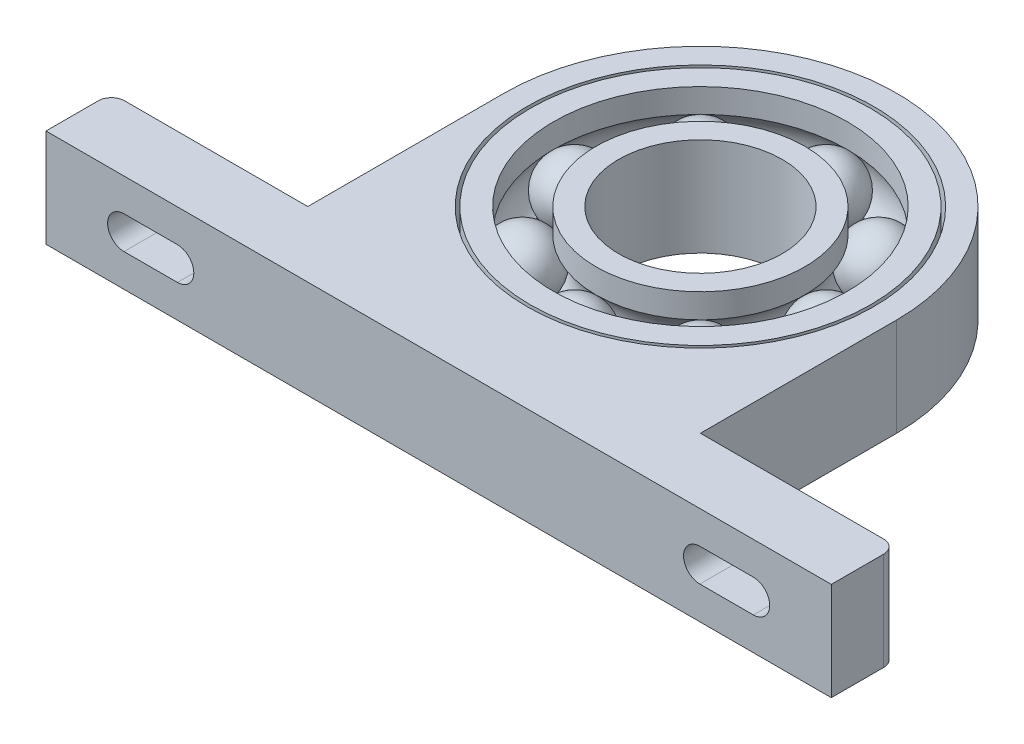
ISO-10303-21;
HEADER;
FILE_DESCRIPTION(('STEP AP214'),'2;1');
FILE_NAME('part.step','',(''),(''),'','','');
FILE_SCHEMA(('AUTOMOTIVE_DESIGN { 1 0 10303 214 1 1 1 1 }'));
ENDSEC;
DATA;
#1=APPLICATION_CONTEXT('core data for automotive mechanical design processes');
#2=APPLICATION_PROTOCOL_DEFINITION('international standard','automotive_design',2000,#1);
#3=PRODUCT_CONTEXT('',#1,'mechanical');
#4=PRODUCT('Part','Part','',(#3));
#5=PRODUCT_RELATED_PRODUCT_CATEGORY('part','',(#4));
#6=PRODUCT_DEFINITION_FORMATION('','',#4);
#7=PRODUCT_DEFINITION_CONTEXT('part definition',#1,'design');
#8=PRODUCT_DEFINITION('design','',#6,#7);
#9=PRODUCT_DEFINITION_SHAPE('','',#8);
#10=(LENGTH_UNIT() NAMED_UNIT(*) SI_UNIT(.MILLI.,.METRE.));
#11=(NAMED_UNIT(*) PLANE_ANGLE_UNIT() SI_UNIT($,.RADIAN.));
#12=(NAMED_UNIT(*) SI_UNIT($,.STERADIAN.) SOLID_ANGLE_UNIT());
#13=UNCERTAINTY_MEASURE_WITH_UNIT(LENGTH_MEASURE(1.E-05),#10,'distance_accuracy_value','');
#14=(GEOMETRIC_REPRESENTATION_CONTEXT(3) GLOBAL_UNCERTAINTY_ASSIGNED_CONTEXT((#13)) GLOBAL_UNIT_ASSIGNED_CONTEXT((#10,
#11,#12)) REPRESENTATION_CONTEXT('',''));
#15=CARTESIAN_POINT('',(0.,0.,0.));
#16=DIRECTION('',(0.,0.,1.));
#17=DIRECTION('',(1.,0.,0.));
#18=AXIS2_PLACEMENT_3D('',#15,#16,#17);
#19=CARTESIAN_POINT('',(60.,7.5,40.));
#20=DIRECTION('',(0.,0.,-1.));
#21=DIRECTION('',(-1.,0.,0.));
#22=AXIS2_PLACEMENT_3D('',#19,#20,#21);
#23=PLANE('',#22);
#24=CARTESIAN_POINT('',(-39.9157719621745,0.,40.));
#25=DIRECTION('',(0.,0.,-1.));
#26=DIRECTION('',(-1.,0.,0.));
#27=AXIS2_PLACEMENT_3D('',#24,#25,#26);
#28=CIRCLE('',#27,2.5);
#29=CARTESIAN_POINT('',(-39.9157719621745,2.5,40.));
#30=VERTEX_POINT('',#29);
#31=CARTESIAN_POINT('',(-39.9157719621745,-2.5,40.));
#32=VERTEX_POINT('',#31);
#33=EDGE_CURVE('E60',#30,#32,#28,.T.);
#34=ORIENTED_EDGE('',*,*,#33,.T.);
#35=DIRECTION('',(-1.,0.,0.));
#36=VECTOR('',#35,1.);
#37=CARTESIAN_POINT('',(60.,-2.50000000000001,40.));
#38=LINE('',#37,#36);
#39=CARTESIAN_POINT('',(-48.0842280378255,-2.5,40.));
#40=VERTEX_POINT('',#39);
#41=EDGE_CURVE('E12',#32,#40,#38,.T.);
#42=ORIENTED_EDGE('',*,*,#41,.T.);
#43=CARTESIAN_POINT('',(-48.0842280378255,0.,40.));
#44=DIRECTION('',(0.,0.,-1.));
#45=DIRECTION('',(-1.,0.,0.));
#46=AXIS2_PLACEMENT_3D('',#43,#44,#45);
#47=CIRCLE('',#46,2.5);
#48=CARTESIAN_POINT('',(-48.0842280378255,2.5,40.));
#49=VERTEX_POINT('',#48);
#50=EDGE_CURVE('E316',#40,#49,#47,.T.);
#51=ORIENTED_EDGE('',*,*,#50,.T.);
#52=DIRECTION('',(-1.,0.,0.));
#53=VECTOR('',#52,1.);
#54=CARTESIAN_POINT('',(60.,2.5,40.));
#55=LINE('',#54,#53);
#56=EDGE_CURVE('E183',#30,#49,#55,.T.);
#57=ORIENTED_EDGE('',*,*,#56,.F.);
#58=EDGE_LOOP('',(#34,#42,#51,#57));
#59=FACE_BOUND('',#58,.T.);
#60=DIRECTION('',(1.,0.,0.));
#61=VECTOR('',#60,1.);
#62=CARTESIAN_POINT('',(60.,-7.5,40.));
#63=LINE('',#62,#61);
#64=CARTESIAN_POINT('',(-60.,-7.5,40.));
#65=VERTEX_POINT('',#64);
#66=CARTESIAN_POINT('',(60.,-7.5,40.));
#67=VERTEX_POINT('',#66);
#68=EDGE_CURVE('E273',#65,#67,#63,.T.);
#69=ORIENTED_EDGE('',*,*,#68,.T.);
#70=DIRECTION('',(0.,-1.,0.));
#71=VECTOR('',#70,1.);
#72=CARTESIAN_POINT('',(60.,7.5,40.));
#73=LINE('',#72,#71);
#74=CARTESIAN_POINT('',(60.,7.5,40.));
#75=VERTEX_POINT('',#74);
#76=EDGE_CURVE('E286',#75,#67,#73,.T.);
#77=ORIENTED_EDGE('',*,*,#76,.F.);
#78=DIRECTION('',(1.,0.,0.));
#79=VECTOR('',#78,1.);
#80=CARTESIAN_POINT('',(60.,7.5,40.));
#81=LINE('',#80,#79);
#82=CARTESIAN_POINT('',(-60.,7.5,40.));
#83=VERTEX_POINT('',#82);
#84=EDGE_CURVE('E254',#83,#75,#81,.T.);
#85=ORIENTED_EDGE('',*,*,#84,.F.);
#86=DIRECTION('',(0.,-1.,0.));
#87=VECTOR('',#86,1.);
#88=CARTESIAN_POINT('',(-60.,7.5,40.));
#89=LINE('',#88,#87);
#90=EDGE_CURVE('E289',#83,#65,#89,.T.);
#91=ORIENTED_EDGE('',*,*,#90,.T.);
#92=EDGE_LOOP('',(#69,#77,#85,#91));
#93=FACE_BOUND('',#92,.T.);
#94=CARTESIAN_POINT('',(48.0842280378255,0.,40.));
#95=DIRECTION('',(0.,0.,-1.));
#96=DIRECTION('',(-1.,0.,0.));
#97=AXIS2_PLACEMENT_3D('',#94,#95,#96);
#98=CIRCLE('',#97,2.5);
#99=CARTESIAN_POINT('',(48.0842280378255,-2.5,40.));
#100=VERTEX_POINT('',#99);
#101=CARTESIAN_POINT('',(48.0842280378255,2.5,40.));
#102=VERTEX_POINT('',#101);
#103=EDGE_CURVE('E234',#100,#102,#98,.F.);
#104=ORIENTED_EDGE('',*,*,#103,.F.);
#105=DIRECTION('',(1.,0.,0.));
#106=VECTOR('',#105,1.);
#107=CARTESIAN_POINT('',(60.,-2.5,40.));
#108=LINE('',#107,#106);
#109=CARTESIAN_POINT('',(39.9157719621745,-2.5,40.));
#110=VERTEX_POINT('',#109);
#111=EDGE_CURVE('E203',#110,#100,#108,.T.);
#112=ORIENTED_EDGE('',*,*,#111,.F.);
#113=CARTESIAN_POINT('',(39.9157719621745,0.,40.));
#114=DIRECTION('',(0.,0.,-1.));
#115=DIRECTION('',(-1.,0.,0.));
#116=AXIS2_PLACEMENT_3D('',#113,#114,#115);
#117=CIRCLE('',#116,2.5);
#118=CARTESIAN_POINT('',(39.9157719621745,2.5,40.));
#119=VERTEX_POINT('',#118);
#120=EDGE_CURVE('E228',#119,#110,#117,.F.);
#121=ORIENTED_EDGE('',*,*,#120,.F.);
#122=DIRECTION('',(1.,0.,0.));
#123=VECTOR('',#122,1.);
#124=CARTESIAN_POINT('',(60.,2.5,40.));
#125=LINE('',#124,#123);
#126=EDGE_CURVE('E231',#119,#102,#125,.T.);
#127=ORIENTED_EDGE('',*,*,#126,.T.);
#128=EDGE_LOOP('',(#104,#112,#121,#127));
#129=FACE_BOUND('',#128,.T.);
#130=ADVANCED_FACE('F52',(#59,#93,#129),#23,.F.);
#131=CARTESIAN_POINT('',(30.,7.5,30.));
#132=DIRECTION('',(0.,0.,1.));
#133=DIRECTION('',(1.,0.,0.));
#134=AXIS2_PLACEMENT_3D('',#131,#132,#133);
#135=PLANE('',#134);
#136=DIRECTION('',(-1.,0.,0.));
#137=VECTOR('',#136,1.);
#138=CARTESIAN_POINT('',(30.,7.5,30.));
#139=LINE('',#138,#137);
#140=CARTESIAN_POINT('',(58.,7.5,30.));
#141=VERTEX_POINT('',#140);
#142=CARTESIAN_POINT('',(30.,7.5,30.));
#143=VERTEX_POINT('',#142);
#144=EDGE_CURVE('E259',#141,#143,#139,.T.);
#145=ORIENTED_EDGE('',*,*,#144,.F.);
#146=DIRECTION('',(0.,-1.,0.));
#147=VECTOR('',#146,1.);
#148=CARTESIAN_POINT('',(58.,7.5,30.));
#149=LINE('',#148,#147);
#150=CARTESIAN_POINT('',(58.,-7.5,30.));
#151=VERTEX_POINT('',#150);
#152=EDGE_CURVE('E298',#141,#151,#149,.T.);
#153=ORIENTED_EDGE('',*,*,#152,.T.);
#154=DIRECTION('',(-1.,0.,0.));
#155=VECTOR('',#154,1.);
#156=CARTESIAN_POINT('',(30.,-7.5,30.));
#157=LINE('',#156,#155);
#158=CARTESIAN_POINT('',(30.,-7.5,30.));
#159=VERTEX_POINT('',#158);
#160=EDGE_CURVE('E278',#151,#159,#157,.T.);
#161=ORIENTED_EDGE('',*,*,#160,.T.);
#162=DIRECTION('',(0.,-1.,0.));
#163=VECTOR('',#162,1.);
#164=CARTESIAN_POINT('',(30.,7.5,30.));
#165=LINE('',#164,#163);
#166=EDGE_CURVE('E283',#143,#159,#165,.T.);
#167=ORIENTED_EDGE('',*,*,#166,.F.);
#168=EDGE_LOOP('',(#145,#153,#161,#167));
#169=FACE_BOUND('',#168,.T.);
#170=CARTESIAN_POINT('',(48.0842280378255,0.,30.));
#171=DIRECTION('',(0.,0.,-1.));
#172=DIRECTION('',(-1.,0.,0.));
#173=AXIS2_PLACEMENT_3D('',#170,#171,#172);
#174=CIRCLE('',#173,2.5);
#175=CARTESIAN_POINT('',(48.0842280378255,-2.5,30.));
#176=VERTEX_POINT('',#175);
#177=CARTESIAN_POINT('',(48.0842280378255,2.5,30.));
#178=VERTEX_POINT('',#177);
#179=EDGE_CURVE('E206',#176,#178,#174,.F.);
#180=ORIENTED_EDGE('',*,*,#179,.T.);
#181=DIRECTION('',(1.,0.,0.));
#182=VECTOR('',#181,1.);
#183=CARTESIAN_POINT('',(0.,2.5,30.));
#184=LINE('',#183,#182);
#185=CARTESIAN_POINT('',(39.9157719621745,2.5,30.));
#186=VERTEX_POINT('',#185);
#187=EDGE_CURVE('E215',#186,#178,#184,.T.);
#188=ORIENTED_EDGE('',*,*,#187,.F.);
#189=CARTESIAN_POINT('',(39.9157719621745,0.,30.));
#190=DIRECTION('',(0.,0.,-1.));
#191=DIRECTION('',(-1.,0.,0.));
#192=AXIS2_PLACEMENT_3D('',#189,#190,#191);
#193=CIRCLE('',#192,2.5);
#194=CARTESIAN_POINT('',(39.9157719621745,-2.5,30.));
#195=VERTEX_POINT('',#194);
#196=EDGE_CURVE('E212',#186,#195,#193,.F.);
#197=ORIENTED_EDGE('',*,*,#196,.T.);
#198=DIRECTION('',(1.,0.,0.));
#199=VECTOR('',#198,1.);
#200=CARTESIAN_POINT('',(0.,-2.5,30.));
#201=LINE('',#200,#199);
#202=EDGE_CURVE('E209',#195,#176,#201,.T.);
#203=ORIENTED_EDGE('',*,*,#202,.T.);
#204=EDGE_LOOP('',(#180,#188,#197,#203));
#205=FACE_BOUND('',#204,.T.);
#206=ADVANCED_FACE('F339',(#169,#205),#135,.F.);
#207=CARTESIAN_POINT('',(0.,7.5,0.));
#208=DIRECTION('',(0.,1.,0.));
#209=DIRECTION('',(0.,0.,1.));
#210=AXIS2_PLACEMENT_3D('',#207,#208,#209);
#211=PLANE('',#210);
#212=DIRECTION('',(0.,0.,-1.));
#213=VECTOR('',#212,1.);
#214=CARTESIAN_POINT('',(60.,7.5,30.));
#215=LINE('',#214,#213);
#216=CARTESIAN_POINT('',(60.,7.5,32.));
#217=VERTEX_POINT('',#216);
#218=EDGE_CURVE('E256',#75,#217,#215,.T.);
#219=ORIENTED_EDGE('',*,*,#218,.T.);
#220=CARTESIAN_POINT('',(58.,7.5,32.));
#221=DIRECTION('',(0.,1.,0.));
#222=DIRECTION('',(0.,0.,1.));
#223=AXIS2_PLACEMENT_3D('',#220,#221,#222);
#224=CIRCLE('',#223,2.);
#225=EDGE_CURVE('E309',#217,#141,#224,.T.);
#226=ORIENTED_EDGE('',*,*,#225,.T.);
#227=ORIENTED_EDGE('',*,*,#144,.T.);
#228=DIRECTION('',(0.,0.,-1.));
#229=VECTOR('',#228,1.);
#230=CARTESIAN_POINT('',(30.,7.5,0.));
#231=LINE('',#230,#229);
#232=CARTESIAN_POINT('',(30.,7.5,0.));
#233=VERTEX_POINT('',#232);
#234=EDGE_CURVE('E261',#143,#233,#231,.T.);
#235=ORIENTED_EDGE('',*,*,#234,.T.);
#236=CARTESIAN_POINT('',(0.,7.5,0.));
#237=DIRECTION('',(0.,1.,0.));
#238=DIRECTION('',(0.,0.,1.));
#239=AXIS2_PLACEMENT_3D('',#236,#237,#238);
#240=CIRCLE('',#239,30.);
#241=CARTESIAN_POINT('',(-30.,7.5,0.));
#242=VERTEX_POINT('',#241);
#243=EDGE_CURVE('E243',#233,#242,#240,.T.);
#244=ORIENTED_EDGE('',*,*,#243,.T.);
#245=DIRECTION('',(0.,0.,1.));
#246=VECTOR('',#245,1.);
#247=CARTESIAN_POINT('',(-30.,7.5,30.));
#248=LINE('',#247,#246);
#249=CARTESIAN_POINT('',(-30.,7.5,30.));
#250=VERTEX_POINT('',#249);
#251=EDGE_CURVE('E246',#242,#250,#248,.T.);
#252=ORIENTED_EDGE('',*,*,#251,.T.);
#253=DIRECTION('',(-1.,0.,0.));
#254=VECTOR('',#253,1.);
#255=CARTESIAN_POINT('',(-60.,7.5,30.));
#256=LINE('',#255,#254);
#257=CARTESIAN_POINT('',(-58.,7.5,30.));
#258=VERTEX_POINT('',#257);
#259=EDGE_CURVE('E249',#250,#258,#256,.T.);
#260=ORIENTED_EDGE('',*,*,#259,.T.);
#261=CARTESIAN_POINT('',(-58.,7.5,32.));
#262=DIRECTION('',(0.,1.,0.));
#263=DIRECTION('',(0.,0.,1.));
#264=AXIS2_PLACEMENT_3D('',#261,#262,#263);
#265=CIRCLE('',#264,2.);
#266=CARTESIAN_POINT('',(-60.,7.5,32.));
#267=VERTEX_POINT('',#266);
#268=EDGE_CURVE('E307',#258,#267,#265,.T.);
#269=ORIENTED_EDGE('',*,*,#268,.T.);
#270=DIRECTION('',(0.,0.,1.));
#271=VECTOR('',#270,1.);
#272=CARTESIAN_POINT('',(-60.,7.5,40.));
#273=LINE('',#272,#271);
#274=EDGE_CURVE('E252',#267,#83,#273,.T.);
#275=ORIENTED_EDGE('',*,*,#274,.T.);
#276=ORIENTED_EDGE('',*,*,#84,.T.);
#277=EDGE_LOOP('',(#219,#226,#227,#235,#244,#252,#260,#269,#275,#276));
#278=FACE_BOUND('',#277,.T.);
#279=CARTESIAN_POINT('',(0.,7.5,0.));
#280=DIRECTION('',(0.,1.,0.));
#281=DIRECTION('',(0.,0.,1.));
#282=AXIS2_PLACEMENT_3D('',#279,#280,#281);
#283=CIRCLE('',#282,26.5);
#284=CARTESIAN_POINT('',(0.,7.5,26.5));
#285=VERTEX_POINT('',#284);
#286=EDGE_CURVE('E237',#285,#285,#283,.T.);
#287=ORIENTED_EDGE('',*,*,#286,.F.);
#288=EDGE_LOOP('',(#287));
#289=FACE_BOUND('',#288,.T.);
#290=ADVANCED_FACE('F344',(#278,#289),#211,.T.);
#291=CARTESIAN_POINT('',(0.,-7.5,0.));
#292=DIRECTION('',(0.,1.,0.));
#293=DIRECTION('',(0.,0.,1.));
#294=AXIS2_PLACEMENT_3D('',#291,#292,#293);
#295=PLANE('',#294);
#296=ORIENTED_EDGE('',*,*,#160,.F.);
#297=CARTESIAN_POINT('',(58.,-7.5,32.));
#298=DIRECTION('',(0.,1.,0.));
#299=DIRECTION('',(0.,0.,1.));
#300=AXIS2_PLACEMENT_3D('',#297,#298,#299);
#301=CIRCLE('',#300,2.);
#302=CARTESIAN_POINT('',(60.,-7.5,32.));
#303=VERTEX_POINT('',#302);
#304=EDGE_CURVE('E303',#151,#303,#301,.F.);
#305=ORIENTED_EDGE('',*,*,#304,.T.);
#306=DIRECTION('',(0.,0.,-1.));
#307=VECTOR('',#306,1.);
#308=CARTESIAN_POINT('',(60.,-7.5,30.));
#309=LINE('',#308,#307);
#310=EDGE_CURVE('E275',#67,#303,#309,.T.);
#311=ORIENTED_EDGE('',*,*,#310,.F.);
#312=ORIENTED_EDGE('',*,*,#68,.F.);
#313=DIRECTION('',(0.,0.,1.));
#314=VECTOR('',#313,1.);
#315=CARTESIAN_POINT('',(-60.,-7.5,40.));
#316=LINE('',#315,#314);
#317=CARTESIAN_POINT('',(-60.,-7.5,32.));
#318=VERTEX_POINT('',#317);
#319=EDGE_CURVE('E271',#318,#65,#316,.T.);
#320=ORIENTED_EDGE('',*,*,#319,.F.);
#321=CARTESIAN_POINT('',(-58.,-7.5,32.));
#322=DIRECTION('',(0.,1.,0.));
#323=DIRECTION('',(0.,0.,1.));
#324=AXIS2_PLACEMENT_3D('',#321,#322,#323);
#325=CIRCLE('',#324,2.);
#326=CARTESIAN_POINT('',(-58.,-7.5,30.));
#327=VERTEX_POINT('',#326);
#328=EDGE_CURVE('E301',#318,#327,#325,.F.);
#329=ORIENTED_EDGE('',*,*,#328,.T.);
#330=DIRECTION('',(-1.,0.,0.));
#331=VECTOR('',#330,1.);
#332=CARTESIAN_POINT('',(-60.,-7.5,30.));
#333=LINE('',#332,#331);
#334=CARTESIAN_POINT('',(-30.,-7.5,30.));
#335=VERTEX_POINT('',#334);
#336=EDGE_CURVE('E268',#335,#327,#333,.T.);
#337=ORIENTED_EDGE('',*,*,#336,.F.);
#338=DIRECTION('',(0.,0.,1.));
#339=VECTOR('',#338,1.);
#340=CARTESIAN_POINT('',(-30.,-7.5,30.));
#341=LINE('',#340,#339);
#342=CARTESIAN_POINT('',(-30.,-7.5,0.));
#343=VERTEX_POINT('',#342);
#344=EDGE_CURVE('E266',#343,#335,#341,.T.);
#345=ORIENTED_EDGE('',*,*,#344,.F.);
#346=CARTESIAN_POINT('',(0.,-7.5,0.));
#347=DIRECTION('',(0.,1.,0.));
#348=DIRECTION('',(0.,0.,1.));
#349=AXIS2_PLACEMENT_3D('',#346,#347,#348);
#350=CIRCLE('',#349,30.);
#351=CARTESIAN_POINT('',(30.,-7.5,0.));
#352=VERTEX_POINT('',#351);
#353=EDGE_CURVE('E240',#352,#343,#350,.T.);
#354=ORIENTED_EDGE('',*,*,#353,.F.);
#355=DIRECTION('',(0.,0.,-1.));
#356=VECTOR('',#355,1.);
#357=CARTESIAN_POINT('',(30.,-7.5,0.));
#358=LINE('',#357,#356);
#359=EDGE_CURVE('E247',#159,#352,#358,.T.);
#360=ORIENTED_EDGE('',*,*,#359,.F.);
#361=EDGE_LOOP('',(#296,#305,#311,#312,#320,#329,#337,#345,#354,#360));
#362=FACE_BOUND('',#361,.T.);
#363=CARTESIAN_POINT('',(0.,-7.5,0.));
#364=DIRECTION('',(0.,1.,0.));
#365=DIRECTION('',(0.,0.,1.));
#366=AXIS2_PLACEMENT_3D('',#363,#364,#365);
#367=CIRCLE('',#366,26.5);
#368=CARTESIAN_POINT('',(0.,-7.5,26.5));
#369=VERTEX_POINT('',#368);
#370=EDGE_CURVE('E236',#369,#369,#367,.T.);
#371=ORIENTED_EDGE('',*,*,#370,.T.);
#372=EDGE_LOOP('',(#371));
#373=FACE_BOUND('',#372,.T.);
#374=ADVANCED_FACE('F362',(#362,#373),#295,.F.);
#375=CARTESIAN_POINT('',(0.,7.5,0.));
#376=DIRECTION('',(0.,-1.,0.));
#377=DIRECTION('',(0.,0.,-1.));
#378=AXIS2_PLACEMENT_3D('',#375,#376,#377);
#379=CYLINDRICAL_SURFACE('',#378,30.);
#380=ORIENTED_EDGE('',*,*,#353,.T.);
#381=DIRECTION('',(0.,-1.,0.));
#382=VECTOR('',#381,1.);
#383=CARTESIAN_POINT('',(-30.,7.5,0.));
#384=LINE('',#383,#382);
#385=EDGE_CURVE('E295',#242,#343,#384,.T.);
#386=ORIENTED_EDGE('',*,*,#385,.F.);
#387=ORIENTED_EDGE('',*,*,#243,.F.);
#388=DIRECTION('',(0.,-1.,0.));
#389=VECTOR('',#388,1.);
#390=CARTESIAN_POINT('',(30.,7.5,0.));
#391=LINE('',#390,#389);
#392=EDGE_CURVE('E263',#233,#352,#391,.T.);
#393=ORIENTED_EDGE('',*,*,#392,.T.);
#394=EDGE_LOOP('',(#380,#386,#387,#393));
#395=FACE_BOUND('',#394,.T.);
#396=ADVANCED_FACE('F359',(#395),#379,.T.);
#397=CARTESIAN_POINT('',(-30.,7.5,30.));
#398=DIRECTION('',(1.,0.,0.));
#399=DIRECTION('',(0.,0.,-1.));
#400=AXIS2_PLACEMENT_3D('',#397,#398,#399);
#401=PLANE('',#400);
#402=ORIENTED_EDGE('',*,*,#344,.T.);
#403=DIRECTION('',(0.,-1.,0.));
#404=VECTOR('',#403,1.);
#405=CARTESIAN_POINT('',(-30.,7.5,30.));
#406=LINE('',#405,#404);
#407=EDGE_CURVE('E292',#250,#335,#406,.T.);
#408=ORIENTED_EDGE('',*,*,#407,.F.);
#409=ORIENTED_EDGE('',*,*,#251,.F.);
#410=ORIENTED_EDGE('',*,*,#385,.T.);
#411=EDGE_LOOP('',(#402,#408,#409,#410));
#412=FACE_BOUND('',#411,.T.);
#413=ADVANCED_FACE('F356',(#412),#401,.F.);
#414=CARTESIAN_POINT('',(-60.,7.5,30.));
#415=DIRECTION('',(0.,0.,1.));
#416=DIRECTION('',(1.,0.,0.));
#417=AXIS2_PLACEMENT_3D('',#414,#415,#416);
#418=PLANE('',#417);
#419=CARTESIAN_POINT('',(-48.0842280378255,0.,30.));
#420=DIRECTION('',(0.,0.,-1.));
#421=DIRECTION('',(-1.,0.,0.));
#422=AXIS2_PLACEMENT_3D('',#419,#420,#421);
#423=CIRCLE('',#422,2.5);
#424=CARTESIAN_POINT('',(-48.0842280378255,-2.5,30.));
#425=VERTEX_POINT('',#424);
#426=CARTESIAN_POINT('',(-48.0842280378255,2.5,30.));
#427=VERTEX_POINT('',#426);
#428=EDGE_CURVE('E189',#425,#427,#423,.T.);
#429=ORIENTED_EDGE('',*,*,#428,.F.);
#430=DIRECTION('',(-1.,0.,0.));
#431=VECTOR('',#430,1.);
#432=CARTESIAN_POINT('',(0.,-2.5,30.));
#433=LINE('',#432,#431);
#434=CARTESIAN_POINT('',(-39.9157719621745,-2.5,30.));
#435=VERTEX_POINT('',#434);
#436=EDGE_CURVE('E67',#435,#425,#433,.T.);
#437=ORIENTED_EDGE('',*,*,#436,.F.);
#438=CARTESIAN_POINT('',(-39.9157719621745,0.,30.));
#439=DIRECTION('',(0.,0.,-1.));
#440=DIRECTION('',(-1.,0.,0.));
#441=AXIS2_PLACEMENT_3D('',#438,#439,#440);
#442=CIRCLE('',#441,2.5);
#443=CARTESIAN_POINT('',(-39.9157719621745,2.5,30.));
#444=VERTEX_POINT('',#443);
#445=EDGE_CURVE('E196',#444,#435,#442,.T.);
#446=ORIENTED_EDGE('',*,*,#445,.F.);
#447=DIRECTION('',(-1.,0.,0.));
#448=VECTOR('',#447,1.);
#449=CARTESIAN_POINT('',(0.,2.5,30.));
#450=LINE('',#449,#448);
#451=EDGE_CURVE('E180',#444,#427,#450,.T.);
#452=ORIENTED_EDGE('',*,*,#451,.T.);
#453=EDGE_LOOP('',(#429,#437,#446,#452));
#454=FACE_BOUND('',#453,.T.);
#455=ORIENTED_EDGE('',*,*,#336,.T.);
#456=DIRECTION('',(0.,-1.,0.));
#457=VECTOR('',#456,1.);
#458=CARTESIAN_POINT('',(-58.,7.5,30.));
#459=LINE('',#458,#457);
#460=EDGE_CURVE('E314',#327,#258,#459,.F.);
#461=ORIENTED_EDGE('',*,*,#460,.T.);
#462=ORIENTED_EDGE('',*,*,#259,.F.);
#463=ORIENTED_EDGE('',*,*,#407,.T.);
#464=EDGE_LOOP('',(#455,#461,#462,#463));
#465=FACE_BOUND('',#464,.T.);
#466=ADVANCED_FACE('F193',(#454,#465),#418,.F.);
#467=CARTESIAN_POINT('',(-60.,7.5,40.));
#468=DIRECTION('',(1.,0.,0.));
#469=DIRECTION('',(0.,0.,-1.));
#470=AXIS2_PLACEMENT_3D('',#467,#468,#469);
#471=PLANE('',#470);
#472=ORIENTED_EDGE('',*,*,#274,.F.);
#473=DIRECTION('',(0.,-1.,0.));
#474=VECTOR('',#473,1.);
#475=CARTESIAN_POINT('',(-60.,7.5,32.));
#476=LINE('',#475,#474);
#477=EDGE_CURVE('E311',#267,#318,#476,.T.);
#478=ORIENTED_EDGE('',*,*,#477,.T.);
#479=ORIENTED_EDGE('',*,*,#319,.T.);
#480=ORIENTED_EDGE('',*,*,#90,.F.);
#481=EDGE_LOOP('',(#472,#478,#479,#480));
#482=FACE_BOUND('',#481,.T.);
#483=ADVANCED_FACE('F350',(#482),#471,.F.);
#484=CARTESIAN_POINT('',(60.,7.5,30.));
#485=DIRECTION('',(-1.,0.,0.));
#486=DIRECTION('',(0.,0.,1.));
#487=AXIS2_PLACEMENT_3D('',#484,#485,#486);
#488=PLANE('',#487);
#489=ORIENTED_EDGE('',*,*,#310,.T.);
#490=DIRECTION('',(0.,-1.,0.));
#491=VECTOR('',#490,1.);
#492=CARTESIAN_POINT('',(60.,7.5,32.));
#493=LINE('',#492,#491);
#494=EDGE_CURVE('E305',#303,#217,#493,.F.);
#495=ORIENTED_EDGE('',*,*,#494,.T.);
#496=ORIENTED_EDGE('',*,*,#218,.F.);
#497=ORIENTED_EDGE('',*,*,#76,.T.);
#498=EDGE_LOOP('',(#489,#495,#496,#497));
#499=FACE_BOUND('',#498,.T.);
#500=ADVANCED_FACE('F349',(#499),#488,.F.);
#501=CARTESIAN_POINT('',(30.,7.5,0.));
#502=DIRECTION('',(-1.,0.,0.));
#503=DIRECTION('',(0.,0.,1.));
#504=AXIS2_PLACEMENT_3D('',#501,#502,#503);
#505=PLANE('',#504);
#506=ORIENTED_EDGE('',*,*,#359,.T.);
#507=ORIENTED_EDGE('',*,*,#392,.F.);
#508=ORIENTED_EDGE('',*,*,#234,.F.);
#509=ORIENTED_EDGE('',*,*,#166,.T.);
#510=EDGE_LOOP('',(#506,#507,#508,#509));
#511=FACE_BOUND('',#510,.T.);
#512=ADVANCED_FACE('F374',(#511),#505,.F.);
#513=CARTESIAN_POINT('',(0.,7.5,0.));
#514=DIRECTION('',(0.,-1.,0.));
#515=DIRECTION('',(0.,0.,-1.));
#516=AXIS2_PLACEMENT_3D('',#513,#514,#515);
#517=CYLINDRICAL_SURFACE('',#516,26.5);
#518=ORIENTED_EDGE('',*,*,#286,.T.);
#519=EDGE_LOOP('',(#518));
#520=FACE_BOUND('',#519,.T.);
#521=ORIENTED_EDGE('',*,*,#370,.F.);
#522=EDGE_LOOP('',(#521));
#523=FACE_BOUND('',#522,.T.);
#524=ADVANCED_FACE('F366',(#520,#523),#517,.F.);
#525=CARTESIAN_POINT('',(58.,7.5,32.));
#526=DIRECTION('',(0.,-1.,0.));
#527=DIRECTION('',(0.,0.,-1.));
#528=AXIS2_PLACEMENT_3D('',#525,#526,#527);
#529=CYLINDRICAL_SURFACE('',#528,2.);
#530=ORIENTED_EDGE('',*,*,#225,.F.);
#531=ORIENTED_EDGE('',*,*,#494,.F.);
#532=ORIENTED_EDGE('',*,*,#304,.F.);
#533=ORIENTED_EDGE('',*,*,#152,.F.);
#534=EDGE_LOOP('',(#530,#531,#532,#533));
#535=FACE_BOUND('',#534,.T.);
#536=ADVANCED_FACE('F364',(#535),#529,.T.);
#537=CARTESIAN_POINT('',(-58.,7.5,32.));
#538=DIRECTION('',(0.,-1.,0.));
#539=DIRECTION('',(0.,0.,-1.));
#540=AXIS2_PLACEMENT_3D('',#537,#538,#539);
#541=CYLINDRICAL_SURFACE('',#540,2.);
#542=ORIENTED_EDGE('',*,*,#268,.F.);
#543=ORIENTED_EDGE('',*,*,#460,.F.);
#544=ORIENTED_EDGE('',*,*,#328,.F.);
#545=ORIENTED_EDGE('',*,*,#477,.F.);
#546=EDGE_LOOP('',(#542,#543,#544,#545));
#547=FACE_BOUND('',#546,.T.);
#548=ADVANCED_FACE('F54',(#547),#541,.T.);
#549=CARTESIAN_POINT('',(48.0842280378255,0.,45.));
#550=DIRECTION('',(0.,0.,-1.));
#551=DIRECTION('',(-1.,0.,0.));
#552=AXIS2_PLACEMENT_3D('',#549,#550,#551);
#553=CYLINDRICAL_SURFACE('',#552,2.5);
#554=ORIENTED_EDGE('',*,*,#103,.T.);
#555=DIRECTION('',(0.,0.,-1.));
#556=VECTOR('',#555,1.);
#557=CARTESIAN_POINT('',(48.0842280378255,2.5,45.));
#558=LINE('',#557,#556);
#559=EDGE_CURVE('E219',#102,#178,#558,.T.);
#560=ORIENTED_EDGE('',*,*,#559,.T.);
#561=ORIENTED_EDGE('',*,*,#179,.F.);
#562=DIRECTION('',(0.,0.,-1.));
#563=VECTOR('',#562,1.);
#564=CARTESIAN_POINT('',(48.0842280378255,-2.5,45.));
#565=LINE('',#564,#563);
#566=EDGE_CURVE('E218',#100,#176,#565,.T.);
#567=ORIENTED_EDGE('',*,*,#566,.F.);
#568=EDGE_LOOP('',(#554,#560,#561,#567));
#569=FACE_BOUND('',#568,.T.);
#570=ADVANCED_FACE('F372',(#569),#553,.F.);
#571=CARTESIAN_POINT('',(0.,2.5,45.));
#572=DIRECTION('',(0.,1.,0.));
#573=DIRECTION('',(0.,0.,1.));
#574=AXIS2_PLACEMENT_3D('',#571,#572,#573);
#575=PLANE('',#574);
#576=DIRECTION('',(0.,0.,-1.));
#577=VECTOR('',#576,1.);
#578=CARTESIAN_POINT('',(39.9157719621745,2.5,45.));
#579=LINE('',#578,#577);
#580=EDGE_CURVE('E221',#119,#186,#579,.T.);
#581=ORIENTED_EDGE('',*,*,#580,.T.);
#582=ORIENTED_EDGE('',*,*,#187,.T.);
#583=ORIENTED_EDGE('',*,*,#559,.F.);
#584=ORIENTED_EDGE('',*,*,#126,.F.);
#585=EDGE_LOOP('',(#581,#582,#583,#584));
#586=FACE_BOUND('',#585,.T.);
#587=ADVANCED_FACE('F424',(#586),#575,.F.);
#588=CARTESIAN_POINT('',(39.9157719621745,0.,45.));
#589=DIRECTION('',(0.,0.,-1.));
#590=DIRECTION('',(-1.,0.,0.));
#591=AXIS2_PLACEMENT_3D('',#588,#589,#590);
#592=CYLINDRICAL_SURFACE('',#591,2.5);
#593=ORIENTED_EDGE('',*,*,#120,.T.);
#594=DIRECTION('',(0.,0.,-1.));
#595=VECTOR('',#594,1.);
#596=CARTESIAN_POINT('',(39.9157719621745,-2.5,45.));
#597=LINE('',#596,#595);
#598=EDGE_CURVE('E223',#110,#195,#597,.T.);
#599=ORIENTED_EDGE('',*,*,#598,.T.);
#600=ORIENTED_EDGE('',*,*,#196,.F.);
#601=ORIENTED_EDGE('',*,*,#580,.F.);
#602=EDGE_LOOP('',(#593,#599,#600,#601));
#603=FACE_BOUND('',#602,.T.);
#604=ADVANCED_FACE('F333',(#603),#592,.F.);
#605=CARTESIAN_POINT('',(0.,-2.5,45.));
#606=DIRECTION('',(0.,1.,0.));
#607=DIRECTION('',(-1.,0.,0.));
#608=AXIS2_PLACEMENT_3D('',#605,#606,#607);
#609=PLANE('',#608);
#610=ORIENTED_EDGE('',*,*,#111,.T.);
#611=ORIENTED_EDGE('',*,*,#566,.T.);
#612=ORIENTED_EDGE('',*,*,#202,.F.);
#613=ORIENTED_EDGE('',*,*,#598,.F.);
#614=EDGE_LOOP('',(#610,#611,#612,#613));
#615=FACE_BOUND('',#614,.T.);
#616=ADVANCED_FACE('F326',(#615),#609,.T.);
#617=CARTESIAN_POINT('',(0.,-2.5,45.));
#618=DIRECTION('',(0.,-1.,0.));
#619=DIRECTION('',(1.,0.,0.));
#620=AXIS2_PLACEMENT_3D('',#617,#618,#619);
#621=PLANE('',#620);
#622=DIRECTION('',(0.,0.,-1.));
#623=VECTOR('',#622,1.);
#624=CARTESIAN_POINT('',(-39.9157719621745,-2.5,45.));
#625=LINE('',#624,#623);
#626=EDGE_CURVE('E201',#32,#435,#625,.T.);
#627=ORIENTED_EDGE('',*,*,#626,.T.);
#628=ORIENTED_EDGE('',*,*,#436,.T.);
#629=DIRECTION('',(0.,0.,-1.));
#630=VECTOR('',#629,1.);
#631=CARTESIAN_POINT('',(-48.0842280378255,-2.5,45.));
#632=LINE('',#631,#630);
#633=EDGE_CURVE('E186',#40,#425,#632,.T.);
#634=ORIENTED_EDGE('',*,*,#633,.F.);
#635=ORIENTED_EDGE('',*,*,#41,.F.);
#636=EDGE_LOOP('',(#627,#628,#634,#635));
#637=FACE_BOUND('',#636,.T.);
#638=ADVANCED_FACE('F324',(#637),#621,.F.);
#639=CARTESIAN_POINT('',(-39.9157719621745,0.,45.));
#640=DIRECTION('',(0.,0.,-1.));
#641=DIRECTION('',(-1.,0.,0.));
#642=AXIS2_PLACEMENT_3D('',#639,#640,#641);
#643=CYLINDRICAL_SURFACE('',#642,2.5);
#644=DIRECTION('',(0.,0.,-1.));
#645=VECTOR('',#644,1.);
#646=CARTESIAN_POINT('',(-39.9157719621745,2.5,45.));
#647=LINE('',#646,#645);
#648=EDGE_CURVE('E185',#30,#444,#647,.T.);
#649=ORIENTED_EDGE('',*,*,#648,.T.);
#650=ORIENTED_EDGE('',*,*,#445,.T.);
#651=ORIENTED_EDGE('',*,*,#626,.F.);
#652=ORIENTED_EDGE('',*,*,#33,.F.);
#653=EDGE_LOOP('',(#649,#650,#651,#652));
#654=FACE_BOUND('',#653,.T.);
#655=ADVANCED_FACE('F323',(#654),#643,.F.);
#656=CARTESIAN_POINT('',(0.,2.5,45.));
#657=DIRECTION('',(0.,-1.,0.));
#658=DIRECTION('',(0.,0.,-1.));
#659=AXIS2_PLACEMENT_3D('',#656,#657,#658);
#660=PLANE('',#659);
#661=ORIENTED_EDGE('',*,*,#56,.T.);
#662=DIRECTION('',(0.,0.,-1.));
#663=VECTOR('',#662,1.);
#664=CARTESIAN_POINT('',(-48.0842280378255,2.5,45.));
#665=LINE('',#664,#663);
#666=EDGE_CURVE('E75',#49,#427,#665,.T.);
#667=ORIENTED_EDGE('',*,*,#666,.T.);
#668=ORIENTED_EDGE('',*,*,#451,.F.);
#669=ORIENTED_EDGE('',*,*,#648,.F.);
#670=EDGE_LOOP('',(#661,#667,#668,#669));
#671=FACE_BOUND('',#670,.T.);
#672=ADVANCED_FACE('F177',(#671),#660,.T.);
#673=CARTESIAN_POINT('',(-48.0842280378255,0.,45.));
#674=DIRECTION('',(0.,0.,-1.));
#675=DIRECTION('',(-1.,0.,0.));
#676=AXIS2_PLACEMENT_3D('',#673,#674,#675);
#677=CYLINDRICAL_SURFACE('',#676,2.5);
#678=ORIENTED_EDGE('',*,*,#633,.T.);
#679=ORIENTED_EDGE('',*,*,#428,.T.);
#680=ORIENTED_EDGE('',*,*,#666,.F.);
#681=ORIENTED_EDGE('',*,*,#50,.F.);
#682=EDGE_LOOP('',(#678,#679,#680,#681));
#683=FACE_BOUND('',#682,.T.);
#684=ADVANCED_FACE('F190',(#683),#677,.F.);
#685=CLOSED_SHELL('',(#130,#206,#290,#374,#396,#413,#466,#483,#500,#512,#524,#536,#548,#570,
#587,#604,#616,#638,#655,#672,#684));
#686=MANIFOLD_SOLID_BREP('B2',#685);
#687=CARTESIAN_POINT('',(-13.5968790899985,0.,-13.5968790899982));
#688=DIRECTION('',(0.,-1.,0.));
#689=DIRECTION('',(-0.707106781186556,0.,-0.707106781186539));
#690=AXIS2_PLACEMENT_3D('',#687,#688,#689);
#691=SPHERICAL_SURFACE('',#690,5.);
#692=CARTESIAN_POINT('',(-13.5968790899985,-5.,-13.5968790899982));
#693=VERTEX_POINT('',#692);
#694=VERTEX_LOOP('',#693);
#695=FACE_BOUND('',#694,.T.);
#696=ADVANCED_FACE('F639',(#695),#691,.T.);
#697=CLOSED_SHELL('',(#696));
#698=MANIFOLD_SOLID_BREP('B6',#697);
#699=CARTESIAN_POINT('',(-2.01411940341913E-13,0.,-19.2288908150228));
#700=DIRECTION('',(0.,-1.,0.));
#701=DIRECTION('',(0.,0.,-1.));
#702=AXIS2_PLACEMENT_3D('',#699,#700,#701);
#703=SPHERICAL_SURFACE('',#702,5.);
#704=CARTESIAN_POINT('',(-2.01411940341913E-13,-5.,-19.2288908150228));
#705=VERTEX_POINT('',#704);
#706=VERTEX_LOOP('',#705);
#707=FACE_BOUND('',#706,.T.);
#708=ADVANCED_FACE('F663',(#707),#703,.T.);
#709=CLOSED_SHELL('',(#708));
#710=MANIFOLD_SOLID_BREP('B48',#709);
#711=CARTESIAN_POINT('',(13.5968790899982,0.,-13.5968790899985));
#712=DIRECTION('',(0.,-1.,0.));
#713=DIRECTION('',(0.707106781186541,0.,-0.707106781186554));
#714=AXIS2_PLACEMENT_3D('',#711,#712,#713);
#715=SPHERICAL_SURFACE('',#714,5.);
#716=CARTESIAN_POINT('',(13.5968790899982,-5.,-13.5968790899985));
#717=VERTEX_POINT('',#716);
#718=VERTEX_LOOP('',#717);
#719=FACE_BOUND('',#718,.T.);
#720=ADVANCED_FACE('F687',(#719),#715,.T.);
#721=CLOSED_SHELL('',(#720));
#722=MANIFOLD_SOLID_BREP('B635',#721);
#723=CARTESIAN_POINT('',(19.2288908150228,0.,0.));
#724=DIRECTION('',(0.,-1.,0.));
#725=DIRECTION('',(1.,0.,0.));
#726=AXIS2_PLACEMENT_3D('',#723,#724,#725);
#727=SPHERICAL_SURFACE('',#726,5.);
#728=CARTESIAN_POINT('',(19.2288908150228,-5.,0.));
#729=VERTEX_POINT('',#728);
#730=VERTEX_LOOP('',#729);
#731=FACE_BOUND('',#730,.T.);
#732=ADVANCED_FACE('F711',(#731),#727,.T.);
#733=CLOSED_SHELL('',(#732));
#734=MANIFOLD_SOLID_BREP('B659',#733);
#735=CARTESIAN_POINT('',(13.5968790899984,0.,13.5968790899983));
#736=DIRECTION('',(0.,-1.,0.));
#737=DIRECTION('',(0.707106781186551,0.,0.707106781186544));
#738=AXIS2_PLACEMENT_3D('',#735,#736,#737);
#739=SPHERICAL_SURFACE('',#738,5.);
#740=CARTESIAN_POINT('',(13.5968790899984,-5.,13.5968790899983));
#741=VERTEX_POINT('',#740);
#742=VERTEX_LOOP('',#741);
#743=FACE_BOUND('',#742,.T.);
#744=ADVANCED_FACE('F735',(#743),#739,.T.);
#745=CLOSED_SHELL('',(#744));
#746=MANIFOLD_SOLID_BREP('B683',#745);
#747=CARTESIAN_POINT('',(0.,0.,19.2288908150228));
#748=DIRECTION('',(0.,-1.,0.));
#749=DIRECTION('',(0.,0.,1.));
#750=AXIS2_PLACEMENT_3D('',#747,#748,#749);
#751=SPHERICAL_SURFACE('',#750,5.);
#752=CARTESIAN_POINT('',(0.,-5.,19.2288908150228));
#753=VERTEX_POINT('',#752);
#754=VERTEX_LOOP('',#753);
#755=FACE_BOUND('',#754,.T.);
#756=ADVANCED_FACE('F759',(#755),#751,.T.);
#757=CLOSED_SHELL('',(#756));
#758=MANIFOLD_SOLID_BREP('B707',#757);
#759=CARTESIAN_POINT('',(-13.5968790899983,0.,13.5968790899984));
#760=DIRECTION('',(0.,-1.,0.));
#761=DIRECTION('',(-0.707106781186546,0.,0.707106781186549));
#762=AXIS2_PLACEMENT_3D('',#759,#760,#761);
#763=SPHERICAL_SURFACE('',#762,5.);
#764=CARTESIAN_POINT('',(-13.5968790899983,-5.,13.5968790899984));
#765=VERTEX_POINT('',#764);
#766=VERTEX_LOOP('',#765);
#767=FACE_BOUND('',#766,.T.);
#768=ADVANCED_FACE('F785',(#767),#763,.T.);
#769=CLOSED_SHELL('',(#768));
#770=MANIFOLD_SOLID_BREP('B731',#769);
#771=CARTESIAN_POINT('',(0.,0.,0.));
#772=DIRECTION('',(0.,-1.,0.));
#773=DIRECTION('',(0.,0.,-1.));
#774=AXIS2_PLACEMENT_3D('',#771,#772,#773);
#775=TOROIDAL_SURFACE('',#774,19.2288908150228,5.);
#776=CARTESIAN_POINT('',(0.,-3.81762545368995,0.));
#777=DIRECTION('',(0.,-1.,0.));
#778=DIRECTION('',(0.,0.,-1.));
#779=AXIS2_PLACEMENT_3D('',#776,#777,#778);
#780=CIRCLE('',#779,22.4577816300456);
#781=CARTESIAN_POINT('',(0.,-3.81762545368995,-22.4577816300456));
#782=VERTEX_POINT('',#781);
#783=EDGE_CURVE('E833',#782,#782,#780,.T.);
#784=ORIENTED_EDGE('',*,*,#783,.T.);
#785=EDGE_LOOP('',(#784));
#786=FACE_BOUND('',#785,.T.);
#787=CARTESIAN_POINT('',(0.,3.81762545368996,0.));
#788=DIRECTION('',(0.,-1.,0.));
#789=DIRECTION('',(0.,0.,-1.));
#790=AXIS2_PLACEMENT_3D('',#787,#788,#789);
#791=CIRCLE('',#790,22.4577816300456);
#792=CARTESIAN_POINT('',(0.,3.81762545368996,-22.4577816300456));
#793=VERTEX_POINT('',#792);
#794=EDGE_CURVE('E784',#793,#793,#791,.T.);
#795=ORIENTED_EDGE('',*,*,#794,.F.);
#796=EDGE_LOOP('',(#795));
#797=FACE_BOUND('',#796,.T.);
#798=ADVANCED_FACE('F811',(#786,#797),#775,.F.);
#799=CARTESIAN_POINT('',(0.,-10.6091466339345,0.));
#800=DIRECTION('',(0.,-1.,0.));
#801=DIRECTION('',(0.,0.,-1.));
#802=AXIS2_PLACEMENT_3D('',#799,#800,#801);
#803=CYLINDRICAL_SURFACE('',#802,22.4577816300456);
#804=ORIENTED_EDGE('',*,*,#794,.T.);
#805=EDGE_LOOP('',(#804));
#806=FACE_BOUND('',#805,.T.);
#807=CARTESIAN_POINT('',(0.,7.5,0.));
#808=DIRECTION('',(0.,-1.,0.));
#809=DIRECTION('',(0.,0.,-1.));
#810=AXIS2_PLACEMENT_3D('',#807,#808,#809);
#811=CIRCLE('',#810,22.4577816300456);
#812=CARTESIAN_POINT('',(0.,7.5,-22.4577816300456));
#813=VERTEX_POINT('',#812);
#814=EDGE_CURVE('E817',#813,#813,#811,.T.);
#815=ORIENTED_EDGE('',*,*,#814,.F.);
#816=EDGE_LOOP('',(#815));
#817=FACE_BOUND('',#816,.T.);
#818=ADVANCED_FACE('F851',(#806,#817),#803,.F.);
#819=CARTESIAN_POINT('',(0.,7.5,0.));
#820=DIRECTION('',(0.,1.,0.));
#821=DIRECTION('',(0.,0.,1.));
#822=AXIS2_PLACEMENT_3D('',#819,#820,#821);
#823=PLANE('',#822);
#824=ORIENTED_EDGE('',*,*,#814,.T.);
#825=EDGE_LOOP('',(#824));
#826=FACE_BOUND('',#825,.T.);
#827=CARTESIAN_POINT('',(0.,7.5,0.));
#828=DIRECTION('',(0.,-1.,0.));
#829=DIRECTION('',(0.,0.,-1.));
#830=AXIS2_PLACEMENT_3D('',#827,#828,#829);
#831=CIRCLE('',#830,26.);
#832=CARTESIAN_POINT('',(0.,7.5,-26.));
#833=VERTEX_POINT('',#832);
#834=EDGE_CURVE('E821',#833,#833,#831,.T.);
#835=ORIENTED_EDGE('',*,*,#834,.F.);
#836=EDGE_LOOP('',(#835));
#837=FACE_BOUND('',#836,.T.);
#838=ADVANCED_FACE('F855',(#826,#837),#823,.T.);
#839=CARTESIAN_POINT('',(0.,-10.6091466339345,0.));
#840=DIRECTION('',(0.,-1.,0.));
#841=DIRECTION('',(0.,0.,-1.));
#842=AXIS2_PLACEMENT_3D('',#839,#840,#841);
#843=CYLINDRICAL_SURFACE('',#842,26.);
#844=CARTESIAN_POINT('',(0.,-7.5,0.));
#845=DIRECTION('',(0.,-1.,0.));
#846=DIRECTION('',(0.,0.,-1.));
#847=AXIS2_PLACEMENT_3D('',#844,#845,#846);
#848=CIRCLE('',#847,26.);
#849=CARTESIAN_POINT('',(0.,-7.5,-26.));
#850=VERTEX_POINT('',#849);
#851=EDGE_CURVE('E825',#850,#850,#848,.T.);
#852=ORIENTED_EDGE('',*,*,#851,.F.);
#853=EDGE_LOOP('',(#852));
#854=FACE_BOUND('',#853,.T.);
#855=ORIENTED_EDGE('',*,*,#834,.T.);
#856=EDGE_LOOP('',(#855));
#857=FACE_BOUND('',#856,.T.);
#858=ADVANCED_FACE('F847',(#854,#857),#843,.T.);
#859=CARTESIAN_POINT('',(0.,-7.5,0.));
#860=DIRECTION('',(0.,1.,0.));
#861=DIRECTION('',(0.,0.,1.));
#862=AXIS2_PLACEMENT_3D('',#859,#860,#861);
#863=PLANE('',#862);
#864=CARTESIAN_POINT('',(0.,-7.5,0.));
#865=DIRECTION('',(0.,-1.,0.));
#866=DIRECTION('',(0.,0.,-1.));
#867=AXIS2_PLACEMENT_3D('',#864,#865,#866);
#868=CIRCLE('',#867,22.4577816300456);
#869=CARTESIAN_POINT('',(0.,-7.5,-22.4577816300456));
#870=VERTEX_POINT('',#869);
#871=EDGE_CURVE('E830',#870,#870,#868,.T.);
#872=ORIENTED_EDGE('',*,*,#871,.F.);
#873=EDGE_LOOP('',(#872));
#874=FACE_BOUND('',#873,.T.);
#875=ORIENTED_EDGE('',*,*,#851,.T.);
#876=EDGE_LOOP('',(#875));
#877=FACE_BOUND('',#876,.T.);
#878=ADVANCED_FACE('F841',(#874,#877),#863,.F.);
#879=CARTESIAN_POINT('',(0.,-10.6091466339345,0.));
#880=DIRECTION('',(0.,-1.,0.));
#881=DIRECTION('',(0.,0.,-1.));
#882=AXIS2_PLACEMENT_3D('',#879,#880,#881);
#883=CYLINDRICAL_SURFACE('',#882,22.4577816300456);
#884=ORIENTED_EDGE('',*,*,#871,.T.);
#885=EDGE_LOOP('',(#884));
#886=FACE_BOUND('',#885,.T.);
#887=ORIENTED_EDGE('',*,*,#783,.F.);
#888=EDGE_LOOP('',(#887));
#889=FACE_BOUND('',#888,.T.);
#890=ADVANCED_FACE('F839',(#886,#889),#883,.F.);
#891=CLOSED_SHELL('',(#798,#818,#838,#858,#878,#890));
#892=MANIFOLD_SOLID_BREP('B755',#891);
#893=CARTESIAN_POINT('',(0.,0.,0.));
#894=DIRECTION('',(0.,-1.,0.));
#895=DIRECTION('',(0.,0.,-1.));
#896=AXIS2_PLACEMENT_3D('',#893,#894,#895);
#897=TOROIDAL_SURFACE('',#896,19.2288908150228,5.);
#898=CARTESIAN_POINT('',(0.,3.78151354618197,0.));
#899=DIRECTION('',(0.,-1.,0.));
#900=DIRECTION('',(0.,0.,-1.));
#901=AXIS2_PLACEMENT_3D('',#898,#899,#900);
#902=CIRCLE('',#901,15.9577816300456);
#903=CARTESIAN_POINT('',(0.,3.78151354618197,-15.9577816300456));
#904=VERTEX_POINT('',#903);
#905=EDGE_CURVE('E939',#904,#904,#902,.T.);
#906=ORIENTED_EDGE('',*,*,#905,.T.);
#907=EDGE_LOOP('',(#906));
#908=FACE_BOUND('',#907,.T.);
#909=CARTESIAN_POINT('',(0.,-3.78151354618197,0.));
#910=DIRECTION('',(0.,-1.,0.));
#911=DIRECTION('',(0.,0.,-1.));
#912=AXIS2_PLACEMENT_3D('',#909,#910,#911);
#913=CIRCLE('',#912,15.9577816300456);
#914=CARTESIAN_POINT('',(0.,-3.78151354618197,-15.9577816300456));
#915=VERTEX_POINT('',#914);
#916=EDGE_CURVE('E810',#915,#915,#913,.T.);
#917=ORIENTED_EDGE('',*,*,#916,.F.);
#918=EDGE_LOOP('',(#917));
#919=FACE_BOUND('',#918,.T.);
#920=ADVANCED_FACE('F917',(#908,#919),#897,.F.);
#921=CARTESIAN_POINT('',(0.,-10.6091466339345,0.));
#922=DIRECTION('',(0.,-1.,0.));
#923=DIRECTION('',(0.,0.,-1.));
#924=AXIS2_PLACEMENT_3D('',#921,#922,#923);
#925=CYLINDRICAL_SURFACE('',#924,15.9577816300456);
#926=CARTESIAN_POINT('',(0.,-7.5,0.));
#927=DIRECTION('',(0.,-1.,0.));
#928=DIRECTION('',(0.,0.,-1.));
#929=AXIS2_PLACEMENT_3D('',#926,#927,#928);
#930=CIRCLE('',#929,15.9577816300456);
#931=CARTESIAN_POINT('',(0.,-7.5,-15.9577816300456));
#932=VERTEX_POINT('',#931);
#933=EDGE_CURVE('E923',#932,#932,#930,.T.);
#934=ORIENTED_EDGE('',*,*,#933,.F.);
#935=EDGE_LOOP('',(#934));
#936=FACE_BOUND('',#935,.T.);
#937=ORIENTED_EDGE('',*,*,#916,.T.);
#938=EDGE_LOOP('',(#937));
#939=FACE_BOUND('',#938,.T.);
#940=ADVANCED_FACE('F963',(#936,#939),#925,.T.);
#941=CARTESIAN_POINT('',(0.,-7.49999999999999,0.));
#942=DIRECTION('',(0.,1.,0.));
#943=DIRECTION('',(0.,0.,1.));
#944=AXIS2_PLACEMENT_3D('',#941,#942,#943);
#945=PLANE('',#944);
#946=CARTESIAN_POINT('',(0.,-7.49999999999999,0.));
#947=DIRECTION('',(0.,-1.,0.));
#948=DIRECTION('',(0.,0.,-1.));
#949=AXIS2_PLACEMENT_3D('',#946,#947,#948);
#950=CIRCLE('',#949,12.5);
#951=CARTESIAN_POINT('',(0.,-7.49999999999999,-12.5));
#952=VERTEX_POINT('',#951);
#953=EDGE_CURVE('E927',#952,#952,#950,.T.);
#954=ORIENTED_EDGE('',*,*,#953,.F.);
#955=EDGE_LOOP('',(#954));
#956=FACE_BOUND('',#955,.T.);
#957=ORIENTED_EDGE('',*,*,#933,.T.);
#958=EDGE_LOOP('',(#957));
#959=FACE_BOUND('',#958,.T.);
#960=ADVANCED_FACE('F959',(#956,#959),#945,.F.);
#961=CARTESIAN_POINT('',(0.,-10.6091466339345,0.));
#962=DIRECTION('',(0.,-1.,0.));
#963=DIRECTION('',(0.,0.,-1.));
#964=AXIS2_PLACEMENT_3D('',#961,#962,#963);
#965=CYLINDRICAL_SURFACE('',#964,12.5);
#966=ORIENTED_EDGE('',*,*,#953,.T.);
#967=EDGE_LOOP('',(#966));
#968=FACE_BOUND('',#967,.T.);
#969=CARTESIAN_POINT('',(0.,7.50000000000001,0.));
#970=DIRECTION('',(0.,-1.,0.));
#971=DIRECTION('',(0.,0.,-1.));
#972=AXIS2_PLACEMENT_3D('',#969,#970,#971);
#973=CIRCLE('',#972,12.5);
#974=CARTESIAN_POINT('',(0.,7.50000000000001,-12.5));
#975=VERTEX_POINT('',#974);
#976=EDGE_CURVE('E931',#975,#975,#973,.T.);
#977=ORIENTED_EDGE('',*,*,#976,.F.);
#978=EDGE_LOOP('',(#977));
#979=FACE_BOUND('',#978,.T.);
#980=ADVANCED_FACE('F953',(#968,#979),#965,.F.);
#981=CARTESIAN_POINT('',(0.,7.5,0.));
#982=DIRECTION('',(0.,1.,0.));
#983=DIRECTION('',(0.,0.,1.));
#984=AXIS2_PLACEMENT_3D('',#981,#982,#983);
#985=PLANE('',#984);
#986=ORIENTED_EDGE('',*,*,#976,.T.);
#987=EDGE_LOOP('',(#986));
#988=FACE_BOUND('',#987,.T.);
#989=CARTESIAN_POINT('',(0.,7.5,0.));
#990=DIRECTION('',(0.,-1.,0.));
#991=DIRECTION('',(0.,0.,-1.));
#992=AXIS2_PLACEMENT_3D('',#989,#990,#991);
#993=CIRCLE('',#992,15.9577816300456);
#994=CARTESIAN_POINT('',(0.,7.5,-15.9577816300456));
#995=VERTEX_POINT('',#994);
#996=EDGE_CURVE('E936',#995,#995,#993,.T.);
#997=ORIENTED_EDGE('',*,*,#996,.F.);
#998=EDGE_LOOP('',(#997));
#999=FACE_BOUND('',#998,.T.);
#1000=ADVANCED_FACE('F948',(#988,#999),#985,.T.);
#1001=CARTESIAN_POINT('',(0.,-10.6091466339345,0.));
#1002=DIRECTION('',(0.,-1.,0.));
#1003=DIRECTION('',(0.,0.,-1.));
#1004=AXIS2_PLACEMENT_3D('',#1001,#1002,#1003);
#1005=CYLINDRICAL_SURFACE('',#1004,15.9577816300456);
#1006=ORIENTED_EDGE('',*,*,#905,.F.);
#1007=EDGE_LOOP('',(#1006));
#1008=FACE_BOUND('',#1007,.T.);
#1009=ORIENTED_EDGE('',*,*,#996,.T.);
#1010=EDGE_LOOP('',(#1009));
#1011=FACE_BOUND('',#1010,.T.);
#1012=ADVANCED_FACE('F945',(#1008,#1011),#1005,.T.);
#1013=CLOSED_SHELL('',(#920,#940,#960,#980,#1000,#1012));
#1014=MANIFOLD_SOLID_BREP('B779',#1013);
#1015=CARTESIAN_POINT('',(-19.2288908150228,0.,0.));
#1016=DIRECTION('',(0.,-1.,0.));
#1017=DIRECTION('',(-1.,0.,0.));
#1018=AXIS2_PLACEMENT_3D('',#1015,#1016,#1017);
#1019=SPHERICAL_SURFACE('',#1018,5.);
#1020=CARTESIAN_POINT('',(-19.2288908150228,-5.,0.));
#1021=VERTEX_POINT('',#1020);
#1022=VERTEX_LOOP('',#1021);
#1023=FACE_BOUND('',#1022,.T.);
#1024=ADVANCED_FACE('F1018',(#1023),#1019,.T.);
#1025=CLOSED_SHELL('',(#1024));
#1026=MANIFOLD_SOLID_BREP('B805',#1025);
#1027=ADVANCED_BREP_SHAPE_REPRESENTATION('',(#18,#686,#698,#710,#722,#734,#746,#758,#770,#892,
#1014,#1026),#14);
#1028=SHAPE_DEFINITION_REPRESENTATION(#9,#1027);
ENDSEC;
END-ISO-10303-21;
